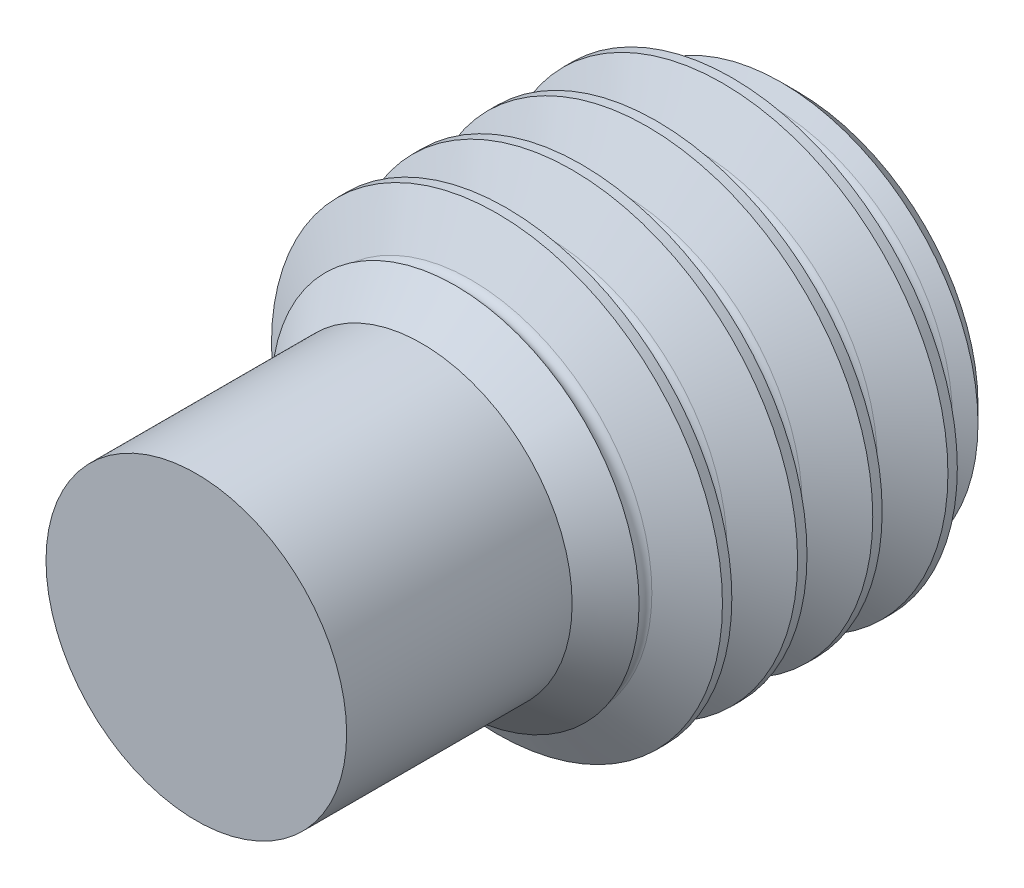
ISO-10303-21;
HEADER;
FILE_DESCRIPTION(('STEP AP214'),'2;1');
FILE_NAME('part.step','',(''),(''),'','','');
FILE_SCHEMA(('AUTOMOTIVE_DESIGN { 1 0 10303 214 1 1 1 1 }'));
ENDSEC;
DATA;
#1=APPLICATION_CONTEXT('core data for automotive mechanical design processes');
#2=APPLICATION_PROTOCOL_DEFINITION('international standard','automotive_design',2000,#1);
#3=PRODUCT_CONTEXT('',#1,'mechanical');
#4=PRODUCT('Part','Part','',(#3));
#5=PRODUCT_RELATED_PRODUCT_CATEGORY('part','',(#4));
#6=PRODUCT_DEFINITION_FORMATION('','',#4);
#7=PRODUCT_DEFINITION_CONTEXT('part definition',#1,'design');
#8=PRODUCT_DEFINITION('design','',#6,#7);
#9=PRODUCT_DEFINITION_SHAPE('','',#8);
#10=(LENGTH_UNIT() NAMED_UNIT(*) SI_UNIT(.MILLI.,.METRE.));
#11=(NAMED_UNIT(*) PLANE_ANGLE_UNIT() SI_UNIT($,.RADIAN.));
#12=(NAMED_UNIT(*) SI_UNIT($,.STERADIAN.) SOLID_ANGLE_UNIT());
#13=UNCERTAINTY_MEASURE_WITH_UNIT(LENGTH_MEASURE(1.E-05),#10,'distance_accuracy_value','');
#14=(GEOMETRIC_REPRESENTATION_CONTEXT(3) GLOBAL_UNCERTAINTY_ASSIGNED_CONTEXT((#13)) GLOBAL_UNIT_ASSIGNED_CONTEXT((#10,
#11,#12)) REPRESENTATION_CONTEXT('',''));
#15=CARTESIAN_POINT('',(0.,0.,0.));
#16=DIRECTION('',(0.,0.,1.));
#17=DIRECTION('',(1.,0.,0.));
#18=AXIS2_PLACEMENT_3D('',#15,#16,#17);
#19=CARTESIAN_POINT('',(0.,1.5,0.));
#20=DIRECTION('',(0.,0.,1.));
#21=DIRECTION('',(0.,-1.,0.));
#22=AXIS2_PLACEMENT_3D('',#19,#20,#21);
#23=PLANE('',#22);
#24=CARTESIAN_POINT('',(0.,0.,0.));
#25=DIRECTION('',(0.,0.,1.));
#26=DIRECTION('',(1.,0.,0.));
#27=AXIS2_PLACEMENT_3D('',#24,#25,#26);
#28=CIRCLE('',#27,1.2);
#29=CARTESIAN_POINT('',(1.2,0.,0.));
#30=VERTEX_POINT('',#29);
#31=EDGE_CURVE('E11',#30,#30,#28,.T.);
#32=ORIENTED_EDGE('',*,*,#31,.F.);
#33=EDGE_LOOP('',(#32));
#34=FACE_BOUND('',#33,.T.);
#35=DIRECTION('',(-0.5,0.866025403784439,0.));
#36=VECTOR('',#35,1.);
#37=CARTESIAN_POINT('',(0.866025403784439,0.,0.));
#38=LINE('',#37,#36);
#39=CARTESIAN_POINT('',(0.866025403784439,0.,0.));
#40=VERTEX_POINT('',#39);
#41=CARTESIAN_POINT('',(0.43301270189222,0.75,0.));
#42=VERTEX_POINT('',#41);
#43=EDGE_CURVE('E50',#40,#42,#38,.T.);
#44=ORIENTED_EDGE('',*,*,#43,.T.);
#45=DIRECTION('',(-1.,0.,0.));
#46=VECTOR('',#45,1.);
#47=CARTESIAN_POINT('',(0.43301270189222,0.75,0.));
#48=LINE('',#47,#46);
#49=CARTESIAN_POINT('',(-0.433012701892219,0.75,0.));
#50=VERTEX_POINT('',#49);
#51=EDGE_CURVE('E127',#42,#50,#48,.T.);
#52=ORIENTED_EDGE('',*,*,#51,.T.);
#53=DIRECTION('',(-0.5,-0.866025403784439,0.));
#54=VECTOR('',#53,1.);
#55=CARTESIAN_POINT('',(-0.433012701892219,0.75,0.));
#56=LINE('',#55,#54);
#57=CARTESIAN_POINT('',(-0.866025403784438,0.,0.));
#58=VERTEX_POINT('',#57);
#59=EDGE_CURVE('E130',#50,#58,#56,.T.);
#60=ORIENTED_EDGE('',*,*,#59,.T.);
#61=DIRECTION('',(0.5,-0.866025403784439,0.));
#62=VECTOR('',#61,1.);
#63=CARTESIAN_POINT('',(-0.866025403784438,0.,0.));
#64=LINE('',#63,#62);
#65=CARTESIAN_POINT('',(-0.433012701892219,-0.75,0.));
#66=VERTEX_POINT('',#65);
#67=EDGE_CURVE('E133',#58,#66,#64,.T.);
#68=ORIENTED_EDGE('',*,*,#67,.T.);
#69=DIRECTION('',(1.,0.,0.));
#70=VECTOR('',#69,1.);
#71=CARTESIAN_POINT('',(-0.433012701892219,-0.75,0.));
#72=LINE('',#71,#70);
#73=CARTESIAN_POINT('',(0.433012701892219,-0.75,0.));
#74=VERTEX_POINT('',#73);
#75=EDGE_CURVE('E97',#66,#74,#72,.T.);
#76=ORIENTED_EDGE('',*,*,#75,.T.);
#77=DIRECTION('',(0.5,0.866025403784439,0.));
#78=VECTOR('',#77,1.);
#79=CARTESIAN_POINT('',(0.433012701892219,-0.75,0.));
#80=LINE('',#79,#78);
#81=EDGE_CURVE('E92',#74,#40,#80,.T.);
#82=ORIENTED_EDGE('',*,*,#81,.T.);
#83=EDGE_LOOP('',(#44,#52,#60,#68,#76,#82));
#84=FACE_BOUND('',#83,.T.);
#85=ADVANCED_FACE('F35',(#34,#84),#23,.F.);
#86=CARTESIAN_POINT('',(0.,0.,4.));
#87=DIRECTION('',(0.,0.,1.));
#88=DIRECTION('',(0.,-1.,0.));
#89=AXIS2_PLACEMENT_3D('',#86,#87,#88);
#90=CYLINDRICAL_SURFACE('',#89,1.5);
#91=CARTESIAN_POINT('',(0.,0.,0.500000000000002));
#92=DIRECTION('',(0.,0.,1.));
#93=DIRECTION('',(1.,0.,0.));
#94=AXIS2_PLACEMENT_3D('',#91,#92,#93);
#95=CIRCLE('',#94,1.5);
#96=CARTESIAN_POINT('',(1.5,0.,0.500000000000002));
#97=VERTEX_POINT('',#96);
#98=EDGE_CURVE('E172',#97,#97,#95,.T.);
#99=ORIENTED_EDGE('',*,*,#98,.F.);
#100=EDGE_LOOP('',(#99));
#101=FACE_BOUND('',#100,.T.);
#102=CARTESIAN_POINT('',(0.,0.,0.437500000000001));
#103=DIRECTION('',(0.,0.,1.));
#104=DIRECTION('',(1.,0.,0.));
#105=AXIS2_PLACEMENT_3D('',#102,#103,#104);
#106=CIRCLE('',#105,1.5);
#107=CARTESIAN_POINT('',(1.5,0.,0.437500000000001));
#108=VERTEX_POINT('',#107);
#109=EDGE_CURVE('E184',#108,#108,#106,.T.);
#110=ORIENTED_EDGE('',*,*,#109,.T.);
#111=EDGE_LOOP('',(#110));
#112=FACE_BOUND('',#111,.T.);
#113=ADVANCED_FACE('F37',(#101,#112),#90,.T.);
#114=CARTESIAN_POINT('',(0.,0.,0.));
#115=DIRECTION('',(0.,0.,-1.));
#116=DIRECTION('',(-1.,0.,0.));
#117=AXIS2_PLACEMENT_3D('',#114,#115,#116);
#118=CONICAL_SURFACE('',#117,1.5,1.0471975511966);
#119=CARTESIAN_POINT('',(0.,0.,0.171874999999998));
#120=DIRECTION('',(0.,0.,1.));
#121=DIRECTION('',(1.,0.,0.));
#122=AXIS2_PLACEMENT_3D('',#119,#120,#121);
#123=CIRCLE('',#122,1.2023037674491);
#124=CARTESIAN_POINT('',(1.2023037674491,0.,0.171874999999998));
#125=VERTEX_POINT('',#124);
#126=EDGE_CURVE('E181',#125,#125,#123,.T.);
#127=ORIENTED_EDGE('',*,*,#126,.F.);
#128=EDGE_LOOP('',(#127));
#129=FACE_BOUND('',#128,.T.);
#130=CARTESIAN_POINT('',(0.,0.,0.109807621135332));
#131=DIRECTION('',(0.,0.,-1.));
#132=DIRECTION('',(-1.,0.,0.));
#133=AXIS2_PLACEMENT_3D('',#130,#131,#132);
#134=CIRCLE('',#133,1.30980762113533);
#135=CARTESIAN_POINT('',(-1.30980762113533,0.,0.109807621135332));
#136=VERTEX_POINT('',#135);
#137=EDGE_CURVE('E39',#136,#136,#134,.T.);
#138=ORIENTED_EDGE('',*,*,#137,.F.);
#139=EDGE_LOOP('',(#138));
#140=FACE_BOUND('',#139,.T.);
#141=ADVANCED_FACE('F194',(#129,#140),#118,.T.);
#142=CARTESIAN_POINT('',(0.,0.,0.265624999999999));
#143=DIRECTION('',(0.,0.,1.));
#144=DIRECTION('',(1.,0.,0.));
#145=AXIS2_PLACEMENT_3D('',#142,#143,#144);
#146=CONICAL_SURFACE('',#145,1.2023037674491,1.0471975511966);
#147=ORIENTED_EDGE('',*,*,#109,.F.);
#148=EDGE_LOOP('',(#147));
#149=FACE_BOUND('',#148,.T.);
#150=CARTESIAN_POINT('',(0.,0.,0.265624999999999));
#151=DIRECTION('',(0.,0.,1.));
#152=DIRECTION('',(1.,0.,0.));
#153=AXIS2_PLACEMENT_3D('',#150,#151,#152);
#154=CIRCLE('',#153,1.2023037674491);
#155=CARTESIAN_POINT('',(1.2023037674491,0.,0.265624999999999));
#156=VERTEX_POINT('',#155);
#157=EDGE_CURVE('E178',#156,#156,#154,.T.);
#158=ORIENTED_EDGE('',*,*,#157,.T.);
#159=EDGE_LOOP('',(#158));
#160=FACE_BOUND('',#159,.T.);
#161=ADVANCED_FACE('F196',(#149,#160),#146,.T.);
#162=CARTESIAN_POINT('',(0.,0.,0.21875));
#163=DIRECTION('',(0.,0.,1.));
#164=DIRECTION('',(1.,0.,0.));
#165=AXIS2_PLACEMENT_3D('',#162,#163,#164);
#166=TOROIDAL_SURFACE('',#165,1.22936706131737,0.0541265877365293);
#167=ORIENTED_EDGE('',*,*,#157,.F.);
#168=EDGE_LOOP('',(#167));
#169=FACE_BOUND('',#168,.T.);
#170=ORIENTED_EDGE('',*,*,#126,.T.);
#171=EDGE_LOOP('',(#170));
#172=FACE_BOUND('',#171,.T.);
#173=ADVANCED_FACE('F203',(#169,#172),#166,.F.);
#174=CARTESIAN_POINT('',(0.,0.,0.));
#175=DIRECTION('',(0.,0.,1.));
#176=DIRECTION('',(1.,0.,0.));
#177=AXIS2_PLACEMENT_3D('',#174,#175,#176);
#178=CONICAL_SURFACE('',#177,1.2,0.785398163397443);
#179=ORIENTED_EDGE('',*,*,#137,.T.);
#180=EDGE_LOOP('',(#179));
#181=FACE_BOUND('',#180,.T.);
#182=ORIENTED_EDGE('',*,*,#31,.T.);
#183=EDGE_LOOP('',(#182));
#184=FACE_BOUND('',#183,.T.);
#185=ADVANCED_FACE('F191',(#181,#184),#178,.T.);
#186=CARTESIAN_POINT('',(0.,0.,0.765624999999999));
#187=DIRECTION('',(0.,0.,1.));
#188=DIRECTION('',(1.,0.,0.));
#189=AXIS2_PLACEMENT_3D('',#186,#187,#188);
#190=CONICAL_SURFACE('',#189,1.2023037674491,1.0471975511966);
#191=CARTESIAN_POINT('',(0.,0.,0.937500000000001));
#192=DIRECTION('',(0.,0.,1.));
#193=DIRECTION('',(1.,0.,0.));
#194=AXIS2_PLACEMENT_3D('',#191,#192,#193);
#195=CIRCLE('',#194,1.5);
#196=CARTESIAN_POINT('',(1.5,0.,0.937500000000001));
#197=VERTEX_POINT('',#196);
#198=EDGE_CURVE('E175',#197,#197,#195,.T.);
#199=ORIENTED_EDGE('',*,*,#198,.F.);
#200=EDGE_LOOP('',(#199));
#201=FACE_BOUND('',#200,.T.);
#202=CARTESIAN_POINT('',(0.,0.,0.765624999999999));
#203=DIRECTION('',(0.,0.,1.));
#204=DIRECTION('',(1.,0.,0.));
#205=AXIS2_PLACEMENT_3D('',#202,#203,#204);
#206=CIRCLE('',#205,1.2023037674491);
#207=CARTESIAN_POINT('',(1.2023037674491,0.,0.765624999999999));
#208=VERTEX_POINT('',#207);
#209=EDGE_CURVE('E166',#208,#208,#206,.T.);
#210=ORIENTED_EDGE('',*,*,#209,.T.);
#211=EDGE_LOOP('',(#210));
#212=FACE_BOUND('',#211,.T.);
#213=ADVANCED_FACE('F224',(#201,#212),#190,.T.);
#214=CARTESIAN_POINT('',(0.,0.,0.500000000000002));
#215=DIRECTION('',(0.,0.,-1.));
#216=DIRECTION('',(-1.,0.,0.));
#217=AXIS2_PLACEMENT_3D('',#214,#215,#216);
#218=CONICAL_SURFACE('',#217,1.5,1.0471975511966);
#219=CARTESIAN_POINT('',(0.,0.,0.671874999999998));
#220=DIRECTION('',(0.,0.,1.));
#221=DIRECTION('',(1.,0.,0.));
#222=AXIS2_PLACEMENT_3D('',#219,#220,#221);
#223=CIRCLE('',#222,1.2023037674491);
#224=CARTESIAN_POINT('',(1.2023037674491,0.,0.671874999999998));
#225=VERTEX_POINT('',#224);
#226=EDGE_CURVE('E169',#225,#225,#223,.T.);
#227=ORIENTED_EDGE('',*,*,#226,.F.);
#228=EDGE_LOOP('',(#227));
#229=FACE_BOUND('',#228,.T.);
#230=ORIENTED_EDGE('',*,*,#98,.T.);
#231=EDGE_LOOP('',(#230));
#232=FACE_BOUND('',#231,.T.);
#233=ADVANCED_FACE('F229',(#229,#232),#218,.T.);
#234=CARTESIAN_POINT('',(0.,0.,0.71875));
#235=DIRECTION('',(0.,0.,1.));
#236=DIRECTION('',(1.,0.,0.));
#237=AXIS2_PLACEMENT_3D('',#234,#235,#236);
#238=TOROIDAL_SURFACE('',#237,1.22936706131737,0.0541265877365293);
#239=ORIENTED_EDGE('',*,*,#209,.F.);
#240=EDGE_LOOP('',(#239));
#241=FACE_BOUND('',#240,.T.);
#242=ORIENTED_EDGE('',*,*,#226,.T.);
#243=EDGE_LOOP('',(#242));
#244=FACE_BOUND('',#243,.T.);
#245=ADVANCED_FACE('F240',(#241,#244),#238,.F.);
#246=CARTESIAN_POINT('',(0.,0.,1.));
#247=DIRECTION('',(0.,0.,1.));
#248=DIRECTION('',(1.,0.,0.));
#249=AXIS2_PLACEMENT_3D('',#246,#247,#248);
#250=CIRCLE('',#249,1.5);
#251=CARTESIAN_POINT('',(1.5,0.,1.));
#252=VERTEX_POINT('',#251);
#253=EDGE_CURVE('E160',#252,#252,#250,.T.);
#254=ORIENTED_EDGE('',*,*,#253,.F.);
#255=EDGE_LOOP('',(#254));
#256=FACE_BOUND('',#255,.T.);
#257=ORIENTED_EDGE('',*,*,#198,.T.);
#258=EDGE_LOOP('',(#257));
#259=FACE_BOUND('',#258,.T.);
#260=ADVANCED_FACE('F208',(#256,#259),#90,.T.);
#261=CARTESIAN_POINT('',(0.,0.,1.265625));
#262=DIRECTION('',(0.,0.,1.));
#263=DIRECTION('',(1.,0.,0.));
#264=AXIS2_PLACEMENT_3D('',#261,#262,#263);
#265=CONICAL_SURFACE('',#264,1.2023037674491,1.0471975511966);
#266=CARTESIAN_POINT('',(0.,0.,1.4375));
#267=DIRECTION('',(0.,0.,1.));
#268=DIRECTION('',(1.,0.,0.));
#269=AXIS2_PLACEMENT_3D('',#266,#267,#268);
#270=CIRCLE('',#269,1.5);
#271=CARTESIAN_POINT('',(1.5,0.,1.4375));
#272=VERTEX_POINT('',#271);
#273=EDGE_CURVE('E163',#272,#272,#270,.T.);
#274=ORIENTED_EDGE('',*,*,#273,.F.);
#275=EDGE_LOOP('',(#274));
#276=FACE_BOUND('',#275,.T.);
#277=CARTESIAN_POINT('',(0.,0.,1.265625));
#278=DIRECTION('',(0.,0.,1.));
#279=DIRECTION('',(1.,0.,0.));
#280=AXIS2_PLACEMENT_3D('',#277,#278,#279);
#281=CIRCLE('',#280,1.2023037674491);
#282=CARTESIAN_POINT('',(1.2023037674491,0.,1.265625));
#283=VERTEX_POINT('',#282);
#284=EDGE_CURVE('E154',#283,#283,#281,.T.);
#285=ORIENTED_EDGE('',*,*,#284,.T.);
#286=EDGE_LOOP('',(#285));
#287=FACE_BOUND('',#286,.T.);
#288=ADVANCED_FACE('F245',(#276,#287),#265,.T.);
#289=CARTESIAN_POINT('',(0.,0.,1.));
#290=DIRECTION('',(0.,0.,-1.));
#291=DIRECTION('',(-1.,0.,0.));
#292=AXIS2_PLACEMENT_3D('',#289,#290,#291);
#293=CONICAL_SURFACE('',#292,1.5,1.0471975511966);
#294=CARTESIAN_POINT('',(0.,0.,1.171875));
#295=DIRECTION('',(0.,0.,1.));
#296=DIRECTION('',(1.,0.,0.));
#297=AXIS2_PLACEMENT_3D('',#294,#295,#296);
#298=CIRCLE('',#297,1.2023037674491);
#299=CARTESIAN_POINT('',(1.2023037674491,0.,1.171875));
#300=VERTEX_POINT('',#299);
#301=EDGE_CURVE('E157',#300,#300,#298,.T.);
#302=ORIENTED_EDGE('',*,*,#301,.F.);
#303=EDGE_LOOP('',(#302));
#304=FACE_BOUND('',#303,.T.);
#305=ORIENTED_EDGE('',*,*,#253,.T.);
#306=EDGE_LOOP('',(#305));
#307=FACE_BOUND('',#306,.T.);
#308=ADVANCED_FACE('F248',(#304,#307),#293,.T.);
#309=CARTESIAN_POINT('',(0.,0.,1.21875));
#310=DIRECTION('',(0.,0.,1.));
#311=DIRECTION('',(1.,0.,0.));
#312=AXIS2_PLACEMENT_3D('',#309,#310,#311);
#313=TOROIDAL_SURFACE('',#312,1.22936706131737,0.0541265877365293);
#314=ORIENTED_EDGE('',*,*,#284,.F.);
#315=EDGE_LOOP('',(#314));
#316=FACE_BOUND('',#315,.T.);
#317=ORIENTED_EDGE('',*,*,#301,.T.);
#318=EDGE_LOOP('',(#317));
#319=FACE_BOUND('',#318,.T.);
#320=ADVANCED_FACE('F252',(#316,#319),#313,.F.);
#321=CARTESIAN_POINT('',(0.,0.,1.5));
#322=DIRECTION('',(0.,0.,1.));
#323=DIRECTION('',(1.,0.,0.));
#324=AXIS2_PLACEMENT_3D('',#321,#322,#323);
#325=CIRCLE('',#324,1.5);
#326=CARTESIAN_POINT('',(1.5,0.,1.5));
#327=VERTEX_POINT('',#326);
#328=EDGE_CURVE('E148',#327,#327,#325,.T.);
#329=ORIENTED_EDGE('',*,*,#328,.F.);
#330=EDGE_LOOP('',(#329));
#331=FACE_BOUND('',#330,.T.);
#332=ORIENTED_EDGE('',*,*,#273,.T.);
#333=EDGE_LOOP('',(#332));
#334=FACE_BOUND('',#333,.T.);
#335=ADVANCED_FACE('F256',(#331,#334),#90,.T.);
#336=CARTESIAN_POINT('',(0.,0.,1.765625));
#337=DIRECTION('',(0.,0.,1.));
#338=DIRECTION('',(1.,0.,0.));
#339=AXIS2_PLACEMENT_3D('',#336,#337,#338);
#340=CONICAL_SURFACE('',#339,1.2023037674491,1.0471975511966);
#341=CARTESIAN_POINT('',(0.,0.,1.9375));
#342=DIRECTION('',(0.,0.,1.));
#343=DIRECTION('',(1.,0.,0.));
#344=AXIS2_PLACEMENT_3D('',#341,#342,#343);
#345=CIRCLE('',#344,1.5);
#346=CARTESIAN_POINT('',(1.5,0.,1.9375));
#347=VERTEX_POINT('',#346);
#348=EDGE_CURVE('E151',#347,#347,#345,.T.);
#349=ORIENTED_EDGE('',*,*,#348,.F.);
#350=EDGE_LOOP('',(#349));
#351=FACE_BOUND('',#350,.T.);
#352=CARTESIAN_POINT('',(0.,0.,1.765625));
#353=DIRECTION('',(0.,0.,1.));
#354=DIRECTION('',(1.,0.,0.));
#355=AXIS2_PLACEMENT_3D('',#352,#353,#354);
#356=CIRCLE('',#355,1.2023037674491);
#357=CARTESIAN_POINT('',(1.2023037674491,0.,1.765625));
#358=VERTEX_POINT('',#357);
#359=EDGE_CURVE('E142',#358,#358,#356,.T.);
#360=ORIENTED_EDGE('',*,*,#359,.T.);
#361=EDGE_LOOP('',(#360));
#362=FACE_BOUND('',#361,.T.);
#363=ADVANCED_FACE('F258',(#351,#362),#340,.T.);
#364=CARTESIAN_POINT('',(0.,0.,1.5));
#365=DIRECTION('',(0.,0.,-1.));
#366=DIRECTION('',(-1.,0.,0.));
#367=AXIS2_PLACEMENT_3D('',#364,#365,#366);
#368=CONICAL_SURFACE('',#367,1.5,1.0471975511966);
#369=CARTESIAN_POINT('',(0.,0.,1.671875));
#370=DIRECTION('',(0.,0.,1.));
#371=DIRECTION('',(1.,0.,0.));
#372=AXIS2_PLACEMENT_3D('',#369,#370,#371);
#373=CIRCLE('',#372,1.2023037674491);
#374=CARTESIAN_POINT('',(1.2023037674491,0.,1.671875));
#375=VERTEX_POINT('',#374);
#376=EDGE_CURVE('E145',#375,#375,#373,.T.);
#377=ORIENTED_EDGE('',*,*,#376,.F.);
#378=EDGE_LOOP('',(#377));
#379=FACE_BOUND('',#378,.T.);
#380=ORIENTED_EDGE('',*,*,#328,.T.);
#381=EDGE_LOOP('',(#380));
#382=FACE_BOUND('',#381,.T.);
#383=ADVANCED_FACE('F261',(#379,#382),#368,.T.);
#384=CARTESIAN_POINT('',(0.,0.,1.71875));
#385=DIRECTION('',(0.,0.,1.));
#386=DIRECTION('',(1.,0.,0.));
#387=AXIS2_PLACEMENT_3D('',#384,#385,#386);
#388=TOROIDAL_SURFACE('',#387,1.22936706131737,0.0541265877365293);
#389=ORIENTED_EDGE('',*,*,#359,.F.);
#390=EDGE_LOOP('',(#389));
#391=FACE_BOUND('',#390,.T.);
#392=ORIENTED_EDGE('',*,*,#376,.T.);
#393=EDGE_LOOP('',(#392));
#394=FACE_BOUND('',#393,.T.);
#395=ADVANCED_FACE('F265',(#391,#394),#388,.F.);
#396=CARTESIAN_POINT('',(0.,0.,2.));
#397=DIRECTION('',(0.,0.,1.));
#398=DIRECTION('',(1.,0.,0.));
#399=AXIS2_PLACEMENT_3D('',#396,#397,#398);
#400=CIRCLE('',#399,1.5);
#401=CARTESIAN_POINT('',(1.5,0.,2.));
#402=VERTEX_POINT('',#401);
#403=EDGE_CURVE('E139',#402,#402,#400,.T.);
#404=ORIENTED_EDGE('',*,*,#403,.F.);
#405=EDGE_LOOP('',(#404));
#406=FACE_BOUND('',#405,.T.);
#407=ORIENTED_EDGE('',*,*,#348,.T.);
#408=EDGE_LOOP('',(#407));
#409=FACE_BOUND('',#408,.T.);
#410=ADVANCED_FACE('F207',(#406,#409),#90,.T.);
#411=CARTESIAN_POINT('',(0.,0.,2.265625));
#412=DIRECTION('',(0.,0.,1.));
#413=DIRECTION('',(1.,0.,0.));
#414=AXIS2_PLACEMENT_3D('',#411,#412,#413);
#415=CONICAL_SURFACE('',#414,1.2023037674491,1.0471975511966);
#416=CARTESIAN_POINT('',(0.,0.,2.27736388584431));
#417=DIRECTION('',(0.,0.,-1.));
#418=DIRECTION('',(-1.,0.,0.));
#419=AXIS2_PLACEMENT_3D('',#416,#417,#418);
#420=CIRCLE('',#419,1.22263611415569);
#421=CARTESIAN_POINT('',(-1.22263611415569,0.,2.27736388584431));
#422=VERTEX_POINT('',#421);
#423=EDGE_CURVE('E135',#422,#422,#420,.T.);
#424=ORIENTED_EDGE('',*,*,#423,.T.);
#425=EDGE_LOOP('',(#424));
#426=FACE_BOUND('',#425,.T.);
#427=CARTESIAN_POINT('',(0.,0.,2.265625));
#428=DIRECTION('',(0.,0.,1.));
#429=DIRECTION('',(1.,0.,0.));
#430=AXIS2_PLACEMENT_3D('',#427,#428,#429);
#431=CIRCLE('',#430,1.2023037674491);
#432=CARTESIAN_POINT('',(1.2023037674491,0.,2.265625));
#433=VERTEX_POINT('',#432);
#434=EDGE_CURVE('E108',#433,#433,#431,.T.);
#435=ORIENTED_EDGE('',*,*,#434,.T.);
#436=EDGE_LOOP('',(#435));
#437=FACE_BOUND('',#436,.T.);
#438=ADVANCED_FACE('F270',(#426,#437),#415,.T.);
#439=CARTESIAN_POINT('',(0.,0.,2.));
#440=DIRECTION('',(0.,0.,-1.));
#441=DIRECTION('',(-1.,0.,0.));
#442=AXIS2_PLACEMENT_3D('',#439,#440,#441);
#443=CONICAL_SURFACE('',#442,1.5,1.0471975511966);
#444=CARTESIAN_POINT('',(0.,0.,2.171875));
#445=DIRECTION('',(0.,0.,1.));
#446=DIRECTION('',(1.,0.,0.));
#447=AXIS2_PLACEMENT_3D('',#444,#445,#446);
#448=CIRCLE('',#447,1.2023037674491);
#449=CARTESIAN_POINT('',(1.2023037674491,0.,2.171875));
#450=VERTEX_POINT('',#449);
#451=EDGE_CURVE('E112',#450,#450,#448,.T.);
#452=ORIENTED_EDGE('',*,*,#451,.F.);
#453=EDGE_LOOP('',(#452));
#454=FACE_BOUND('',#453,.T.);
#455=ORIENTED_EDGE('',*,*,#403,.T.);
#456=EDGE_LOOP('',(#455));
#457=FACE_BOUND('',#456,.T.);
#458=ADVANCED_FACE('F273',(#454,#457),#443,.T.);
#459=CARTESIAN_POINT('',(0.,0.,2.21875));
#460=DIRECTION('',(0.,0.,1.));
#461=DIRECTION('',(1.,0.,0.));
#462=AXIS2_PLACEMENT_3D('',#459,#460,#461);
#463=TOROIDAL_SURFACE('',#462,1.22936706131737,0.0541265877365293);
#464=ORIENTED_EDGE('',*,*,#434,.F.);
#465=EDGE_LOOP('',(#464));
#466=FACE_BOUND('',#465,.T.);
#467=ORIENTED_EDGE('',*,*,#451,.T.);
#468=EDGE_LOOP('',(#467));
#469=FACE_BOUND('',#468,.T.);
#470=ADVANCED_FACE('F277',(#466,#469),#463,.F.);
#471=CARTESIAN_POINT('',(0.866025403784439,0.,3.79128784747792));
#472=DIRECTION('',(-0.866025403784439,-0.5,0.));
#473=DIRECTION('',(0.5,-0.866025403784439,0.));
#474=AXIS2_PLACEMENT_3D('',#471,#472,#473);
#475=PLANE('',#474);
#476=DIRECTION('',(-0.5,0.866025403784439,0.));
#477=VECTOR('',#476,1.);
#478=CARTESIAN_POINT('',(0.866025403784439,0.,1.5));
#479=LINE('',#478,#477);
#480=CARTESIAN_POINT('',(0.866025403784439,0.,1.5));
#481=VERTEX_POINT('',#480);
#482=CARTESIAN_POINT('',(0.43301270189222,0.75,1.5));
#483=VERTEX_POINT('',#482);
#484=EDGE_CURVE('E103',#481,#483,#479,.T.);
#485=ORIENTED_EDGE('',*,*,#484,.T.);
#486=DIRECTION('',(0.,0.,-1.));
#487=VECTOR('',#486,1.);
#488=CARTESIAN_POINT('',(0.43301270189222,0.75,3.79128784747792));
#489=LINE('',#488,#487);
#490=EDGE_CURVE('E125',#483,#42,#489,.T.);
#491=ORIENTED_EDGE('',*,*,#490,.T.);
#492=ORIENTED_EDGE('',*,*,#43,.F.);
#493=DIRECTION('',(0.,0.,-1.));
#494=VECTOR('',#493,1.);
#495=CARTESIAN_POINT('',(0.866025403784439,0.,3.79128784747792));
#496=LINE('',#495,#494);
#497=EDGE_CURVE('E54',#481,#40,#496,.T.);
#498=ORIENTED_EDGE('',*,*,#497,.F.);
#499=EDGE_LOOP('',(#485,#491,#492,#498));
#500=FACE_BOUND('',#499,.T.);
#501=ADVANCED_FACE('F281',(#500),#475,.T.);
#502=CARTESIAN_POINT('',(0.43301270189222,0.75,3.79128784747792));
#503=DIRECTION('',(0.,-1.,0.));
#504=DIRECTION('',(0.,0.,-1.));
#505=AXIS2_PLACEMENT_3D('',#502,#503,#504);
#506=PLANE('',#505);
#507=DIRECTION('',(-1.,0.,0.));
#508=VECTOR('',#507,1.);
#509=CARTESIAN_POINT('',(0.43301270189222,0.75,1.5));
#510=LINE('',#509,#508);
#511=CARTESIAN_POINT('',(-0.433012701892219,0.75,1.5));
#512=VERTEX_POINT('',#511);
#513=EDGE_CURVE('E121',#483,#512,#510,.T.);
#514=ORIENTED_EDGE('',*,*,#513,.T.);
#515=DIRECTION('',(0.,0.,-1.));
#516=VECTOR('',#515,1.);
#517=CARTESIAN_POINT('',(-0.433012701892219,0.75,3.79128784747792));
#518=LINE('',#517,#516);
#519=EDGE_CURVE('E128',#512,#50,#518,.T.);
#520=ORIENTED_EDGE('',*,*,#519,.T.);
#521=ORIENTED_EDGE('',*,*,#51,.F.);
#522=ORIENTED_EDGE('',*,*,#490,.F.);
#523=EDGE_LOOP('',(#514,#520,#521,#522));
#524=FACE_BOUND('',#523,.T.);
#525=ADVANCED_FACE('F288',(#524),#506,.T.);
#526=CARTESIAN_POINT('',(-0.433012701892219,0.75,3.79128784747792));
#527=DIRECTION('',(0.866025403784439,-0.5,0.));
#528=DIRECTION('',(0.5,0.866025403784439,0.));
#529=AXIS2_PLACEMENT_3D('',#526,#527,#528);
#530=PLANE('',#529);
#531=DIRECTION('',(-0.5,-0.866025403784439,0.));
#532=VECTOR('',#531,1.);
#533=CARTESIAN_POINT('',(-0.433012701892219,0.75,1.5));
#534=LINE('',#533,#532);
#535=CARTESIAN_POINT('',(-0.866025403784438,0.,1.5));
#536=VERTEX_POINT('',#535);
#537=EDGE_CURVE('E114',#512,#536,#534,.T.);
#538=ORIENTED_EDGE('',*,*,#537,.T.);
#539=DIRECTION('',(0.,0.,-1.));
#540=VECTOR('',#539,1.);
#541=CARTESIAN_POINT('',(-0.866025403784438,0.,3.79128784747792));
#542=LINE('',#541,#540);
#543=EDGE_CURVE('E131',#536,#58,#542,.T.);
#544=ORIENTED_EDGE('',*,*,#543,.T.);
#545=ORIENTED_EDGE('',*,*,#59,.F.);
#546=ORIENTED_EDGE('',*,*,#519,.F.);
#547=EDGE_LOOP('',(#538,#544,#545,#546));
#548=FACE_BOUND('',#547,.T.);
#549=ADVANCED_FACE('F291',(#548),#530,.T.);
#550=CARTESIAN_POINT('',(-0.866025403784438,0.,3.79128784747792));
#551=DIRECTION('',(0.866025403784439,0.5,0.));
#552=DIRECTION('',(-0.5,0.866025403784439,0.));
#553=AXIS2_PLACEMENT_3D('',#550,#551,#552);
#554=PLANE('',#553);
#555=DIRECTION('',(0.5,-0.866025403784439,0.));
#556=VECTOR('',#555,1.);
#557=CARTESIAN_POINT('',(-0.866025403784438,0.,1.5));
#558=LINE('',#557,#556);
#559=CARTESIAN_POINT('',(-0.433012701892219,-0.75,1.5));
#560=VERTEX_POINT('',#559);
#561=EDGE_CURVE('E109',#536,#560,#558,.T.);
#562=ORIENTED_EDGE('',*,*,#561,.T.);
#563=DIRECTION('',(0.,0.,-1.));
#564=VECTOR('',#563,1.);
#565=CARTESIAN_POINT('',(-0.433012701892219,-0.75,3.79128784747792));
#566=LINE('',#565,#564);
#567=EDGE_CURVE('E106',#560,#66,#566,.T.);
#568=ORIENTED_EDGE('',*,*,#567,.T.);
#569=ORIENTED_EDGE('',*,*,#67,.F.);
#570=ORIENTED_EDGE('',*,*,#543,.F.);
#571=EDGE_LOOP('',(#562,#568,#569,#570));
#572=FACE_BOUND('',#571,.T.);
#573=ADVANCED_FACE('F295',(#572),#554,.T.);
#574=CARTESIAN_POINT('',(-0.433012701892219,-0.75,3.79128784747792));
#575=DIRECTION('',(0.,1.,0.));
#576=DIRECTION('',(-1.,0.,0.));
#577=AXIS2_PLACEMENT_3D('',#574,#575,#576);
#578=PLANE('',#577);
#579=DIRECTION('',(1.,0.,0.));
#580=VECTOR('',#579,1.);
#581=CARTESIAN_POINT('',(-0.433012701892219,-0.75,1.5));
#582=LINE('',#581,#580);
#583=CARTESIAN_POINT('',(0.433012701892219,-0.75,1.5));
#584=VERTEX_POINT('',#583);
#585=EDGE_CURVE('E101',#560,#584,#582,.T.);
#586=ORIENTED_EDGE('',*,*,#585,.T.);
#587=DIRECTION('',(0.,0.,-1.));
#588=VECTOR('',#587,1.);
#589=CARTESIAN_POINT('',(0.433012701892219,-0.75,3.79128784747792));
#590=LINE('',#589,#588);
#591=EDGE_CURVE('E87',#584,#74,#590,.T.);
#592=ORIENTED_EDGE('',*,*,#591,.T.);
#593=ORIENTED_EDGE('',*,*,#75,.F.);
#594=ORIENTED_EDGE('',*,*,#567,.F.);
#595=EDGE_LOOP('',(#586,#592,#593,#594));
#596=FACE_BOUND('',#595,.T.);
#597=ADVANCED_FACE('F105',(#596),#578,.T.);
#598=CARTESIAN_POINT('',(0.433012701892219,-0.75,3.79128784747792));
#599=DIRECTION('',(-0.866025403784439,0.5,0.));
#600=DIRECTION('',(-0.5,-0.866025403784439,0.));
#601=AXIS2_PLACEMENT_3D('',#598,#599,#600);
#602=PLANE('',#601);
#603=DIRECTION('',(0.5,0.866025403784439,0.));
#604=VECTOR('',#603,1.);
#605=CARTESIAN_POINT('',(0.433012701892219,-0.75,1.5));
#606=LINE('',#605,#604);
#607=EDGE_CURVE('E90',#584,#481,#606,.T.);
#608=ORIENTED_EDGE('',*,*,#607,.T.);
#609=ORIENTED_EDGE('',*,*,#497,.T.);
#610=ORIENTED_EDGE('',*,*,#81,.F.);
#611=ORIENTED_EDGE('',*,*,#591,.F.);
#612=EDGE_LOOP('',(#608,#609,#610,#611));
#613=FACE_BOUND('',#612,.T.);
#614=ADVANCED_FACE('F89',(#613),#602,.T.);
#615=CARTESIAN_POINT('',(0.,0.,1.5));
#616=DIRECTION('',(0.,0.,1.));
#617=DIRECTION('',(1.,0.,0.));
#618=AXIS2_PLACEMENT_3D('',#615,#616,#617);
#619=PLANE('',#618);
#620=ORIENTED_EDGE('',*,*,#607,.F.);
#621=ORIENTED_EDGE('',*,*,#585,.F.);
#622=ORIENTED_EDGE('',*,*,#561,.F.);
#623=ORIENTED_EDGE('',*,*,#537,.F.);
#624=ORIENTED_EDGE('',*,*,#513,.F.);
#625=ORIENTED_EDGE('',*,*,#484,.F.);
#626=EDGE_LOOP('',(#620,#621,#622,#623,#624,#625));
#627=FACE_BOUND('',#626,.T.);
#628=ADVANCED_FACE('F100',(#627),#619,.F.);
#629=CARTESIAN_POINT('',(0.,0.,2.));
#630=DIRECTION('',(0.,0.,-1.));
#631=DIRECTION('',(-1.,0.,0.));
#632=AXIS2_PLACEMENT_3D('',#629,#630,#631);
#633=CONICAL_SURFACE('',#632,1.5,0.785398163397449);
#634=CARTESIAN_POINT('',(0.,0.,2.5));
#635=DIRECTION('',(0.,0.,1.));
#636=DIRECTION('',(1.,0.,0.));
#637=AXIS2_PLACEMENT_3D('',#634,#635,#636);
#638=CIRCLE('',#637,1.);
#639=CARTESIAN_POINT('',(1.,0.,2.5));
#640=VERTEX_POINT('',#639);
#641=EDGE_CURVE('E314',#640,#640,#638,.T.);
#642=ORIENTED_EDGE('',*,*,#641,.F.);
#643=EDGE_LOOP('',(#642));
#644=FACE_BOUND('',#643,.T.);
#645=ORIENTED_EDGE('',*,*,#423,.F.);
#646=EDGE_LOOP('',(#645));
#647=FACE_BOUND('',#646,.T.);
#648=ADVANCED_FACE('F285',(#644,#647),#633,.T.);
#649=CARTESIAN_POINT('',(0.,0.,4.));
#650=DIRECTION('',(0.,0.,1.));
#651=DIRECTION('',(1.,0.,0.));
#652=AXIS2_PLACEMENT_3D('',#649,#650,#651);
#653=CYLINDRICAL_SURFACE('',#652,1.);
#654=CARTESIAN_POINT('',(0.,0.,4.));
#655=DIRECTION('',(0.,0.,1.));
#656=DIRECTION('',(1.,0.,0.));
#657=AXIS2_PLACEMENT_3D('',#654,#655,#656);
#658=CIRCLE('',#657,1.);
#659=CARTESIAN_POINT('',(1.,0.,4.));
#660=VERTEX_POINT('',#659);
#661=EDGE_CURVE('E317',#660,#660,#658,.T.);
#662=ORIENTED_EDGE('',*,*,#661,.F.);
#663=EDGE_LOOP('',(#662));
#664=FACE_BOUND('',#663,.T.);
#665=ORIENTED_EDGE('',*,*,#641,.T.);
#666=EDGE_LOOP('',(#665));
#667=FACE_BOUND('',#666,.T.);
#668=ADVANCED_FACE('F221',(#664,#667),#653,.T.);
#669=CARTESIAN_POINT('',(0.,1.5,4.));
#670=DIRECTION('',(0.,0.,-1.));
#671=DIRECTION('',(0.,1.,0.));
#672=AXIS2_PLACEMENT_3D('',#669,#670,#671);
#673=PLANE('',#672);
#674=ORIENTED_EDGE('',*,*,#661,.T.);
#675=EDGE_LOOP('',(#674));
#676=FACE_BOUND('',#675,.T.);
#677=ADVANCED_FACE('F218',(#676),#673,.F.);
#678=CLOSED_SHELL('',(#85,#113,#141,#161,#173,#185,#213,#233,#245,#260,#288,#308,#320,#335,#363,
#383,#395,#410,#438,#458,#470,#501,#525,#549,#573,#597,#614,#628,#648,#668,#677));
#679=MANIFOLD_SOLID_BREP('B2',#678);
#680=ADVANCED_BREP_SHAPE_REPRESENTATION('',(#18,#679),#14);
#681=SHAPE_DEFINITION_REPRESENTATION(#9,#680);
ENDSEC;
END-ISO-10303-21;
